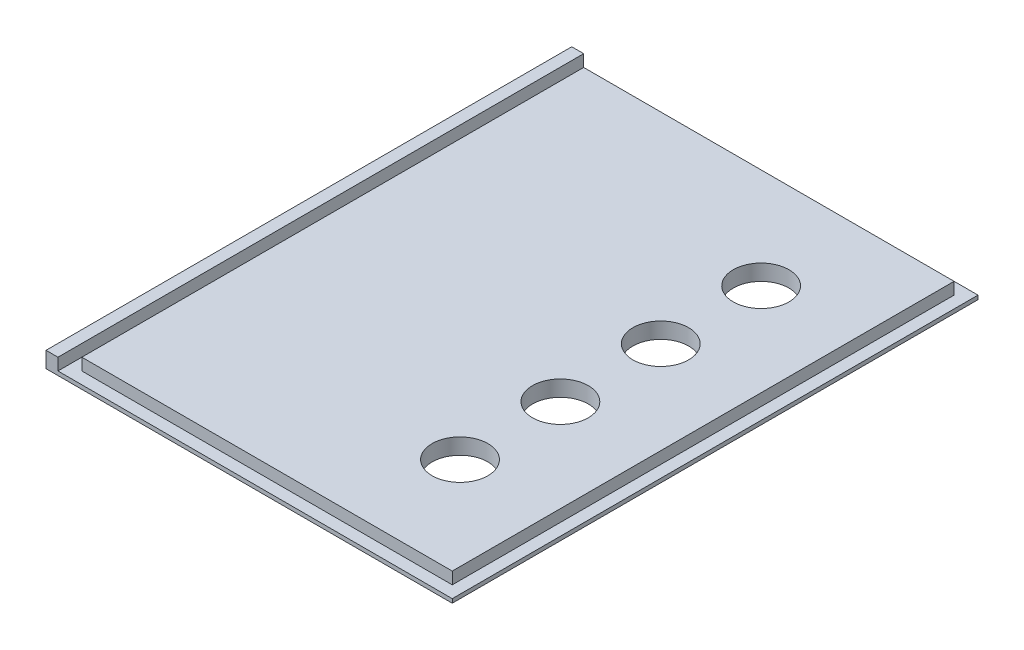
ISO-10303-21;
HEADER;
FILE_DESCRIPTION(('STEP AP214'),'2;1');
FILE_NAME('part.step','',(''),(''),'','','');
FILE_SCHEMA(('AUTOMOTIVE_DESIGN { 1 0 10303 214 1 1 1 1 }'));
ENDSEC;
DATA;
#1=APPLICATION_CONTEXT('core data for automotive mechanical design processes');
#2=APPLICATION_PROTOCOL_DEFINITION('international standard','automotive_design',2000,#1);
#3=PRODUCT_CONTEXT('',#1,'mechanical');
#4=PRODUCT('Part','Part','',(#3));
#5=PRODUCT_RELATED_PRODUCT_CATEGORY('part','',(#4));
#6=PRODUCT_DEFINITION_FORMATION('','',#4);
#7=PRODUCT_DEFINITION_CONTEXT('part definition',#1,'design');
#8=PRODUCT_DEFINITION('design','',#6,#7);
#9=PRODUCT_DEFINITION_SHAPE('','',#8);
#10=(LENGTH_UNIT() NAMED_UNIT(*) SI_UNIT(.MILLI.,.METRE.));
#11=(NAMED_UNIT(*) PLANE_ANGLE_UNIT() SI_UNIT($,.RADIAN.));
#12=(NAMED_UNIT(*) SI_UNIT($,.STERADIAN.) SOLID_ANGLE_UNIT());
#13=UNCERTAINTY_MEASURE_WITH_UNIT(LENGTH_MEASURE(1.E-05),#10,'distance_accuracy_value','');
#14=(GEOMETRIC_REPRESENTATION_CONTEXT(3) GLOBAL_UNCERTAINTY_ASSIGNED_CONTEXT((#13)) GLOBAL_UNIT_ASSIGNED_CONTEXT((#10,
#11,#12)) REPRESENTATION_CONTEXT('',''));
#15=CARTESIAN_POINT('',(0.,0.,0.));
#16=DIRECTION('',(0.,0.,1.));
#17=DIRECTION('',(1.,0.,0.));
#18=AXIS2_PLACEMENT_3D('',#15,#16,#17);
#19=CARTESIAN_POINT('',(0.,1.,0.));
#20=DIRECTION('',(0.,1.,0.));
#21=DIRECTION('',(0.,0.,1.));
#22=AXIS2_PLACEMENT_3D('',#19,#20,#21);
#23=PLANE('',#22);
#24=DIRECTION('',(0.,0.,-1.));
#25=VECTOR('',#24,1.);
#26=CARTESIAN_POINT('',(-48.,1.,-66.));
#27=LINE('',#26,#25);
#28=CARTESIAN_POINT('',(-48.,1.,66.));
#29=VERTEX_POINT('',#28);
#30=CARTESIAN_POINT('',(-48.,1.,-66.));
#31=VERTEX_POINT('',#30);
#32=EDGE_CURVE('E56',#29,#31,#27,.T.);
#33=ORIENTED_EDGE('',*,*,#32,.F.);
#34=DIRECTION('',(1.,0.,0.));
#35=VECTOR('',#34,1.);
#36=CARTESIAN_POINT('',(-51.,1.,66.));
#37=LINE('',#36,#35);
#38=CARTESIAN_POINT('',(51.,1.,66.));
#39=VERTEX_POINT('',#38);
#40=EDGE_CURVE('E163',#29,#39,#37,.T.);
#41=ORIENTED_EDGE('',*,*,#40,.T.);
#42=DIRECTION('',(0.,0.,-1.));
#43=VECTOR('',#42,1.);
#44=CARTESIAN_POINT('',(51.,1.,-66.));
#45=LINE('',#44,#43);
#46=CARTESIAN_POINT('',(51.,1.,-66.));
#47=VERTEX_POINT('',#46);
#48=EDGE_CURVE('E157',#39,#47,#45,.T.);
#49=ORIENTED_EDGE('',*,*,#48,.T.);
#50=DIRECTION('',(-1.,0.,0.));
#51=VECTOR('',#50,1.);
#52=CARTESIAN_POINT('',(-51.,1.,-66.));
#53=LINE('',#52,#51);
#54=EDGE_CURVE('E160',#47,#31,#53,.T.);
#55=ORIENTED_EDGE('',*,*,#54,.T.);
#56=EDGE_LOOP('',(#33,#41,#49,#55));
#57=FACE_BOUND('',#56,.T.);
#58=DIRECTION('',(-1.,0.,0.));
#59=VECTOR('',#58,1.);
#60=CARTESIAN_POINT('',(-45.,1.,-63.));
#61=LINE('',#60,#59);
#62=CARTESIAN_POINT('',(48.,1.,-63.));
#63=VERTEX_POINT('',#62);
#64=CARTESIAN_POINT('',(-45.,1.,-63.));
#65=VERTEX_POINT('',#64);
#66=EDGE_CURVE('E347',#63,#65,#61,.T.);
#67=ORIENTED_EDGE('',*,*,#66,.F.);
#68=DIRECTION('',(0.,0.,-1.));
#69=VECTOR('',#68,1.);
#70=CARTESIAN_POINT('',(48.,1.,-63.));
#71=LINE('',#70,#69);
#72=CARTESIAN_POINT('',(48.,1.,63.));
#73=VERTEX_POINT('',#72);
#74=EDGE_CURVE('E133',#73,#63,#71,.T.);
#75=ORIENTED_EDGE('',*,*,#74,.F.);
#76=DIRECTION('',(1.,0.,0.));
#77=VECTOR('',#76,1.);
#78=CARTESIAN_POINT('',(-45.,1.,63.));
#79=LINE('',#78,#77);
#80=CARTESIAN_POINT('',(-45.,1.,63.));
#81=VERTEX_POINT('',#80);
#82=EDGE_CURVE('E129',#81,#73,#79,.T.);
#83=ORIENTED_EDGE('',*,*,#82,.F.);
#84=DIRECTION('',(0.,0.,1.));
#85=VECTOR('',#84,1.);
#86=CARTESIAN_POINT('',(-45.,1.,-63.));
#87=LINE('',#86,#85);
#88=EDGE_CURVE('E349',#65,#81,#87,.T.);
#89=ORIENTED_EDGE('',*,*,#88,.F.);
#90=EDGE_LOOP('',(#67,#75,#83,#89));
#91=FACE_BOUND('',#90,.T.);
#92=ADVANCED_FACE('F33',(#57,#91),#23,.T.);
#93=CARTESIAN_POINT('',(51.,1.,-66.));
#94=DIRECTION('',(-1.,0.,0.));
#95=DIRECTION('',(0.,0.,1.));
#96=AXIS2_PLACEMENT_3D('',#93,#94,#95);
#97=PLANE('',#96);
#98=DIRECTION('',(0.,0.,-1.));
#99=VECTOR('',#98,1.);
#100=CARTESIAN_POINT('',(51.,0.,-66.));
#101=LINE('',#100,#99);
#102=CARTESIAN_POINT('',(51.,0.,66.));
#103=VERTEX_POINT('',#102);
#104=CARTESIAN_POINT('',(51.,0.,-66.));
#105=VERTEX_POINT('',#104);
#106=EDGE_CURVE('E156',#103,#105,#101,.T.);
#107=ORIENTED_EDGE('',*,*,#106,.T.);
#108=DIRECTION('',(0.,-1.,0.));
#109=VECTOR('',#108,1.);
#110=CARTESIAN_POINT('',(51.,1.,-66.));
#111=LINE('',#110,#109);
#112=EDGE_CURVE('E11',#47,#105,#111,.T.);
#113=ORIENTED_EDGE('',*,*,#112,.F.);
#114=ORIENTED_EDGE('',*,*,#48,.F.);
#115=DIRECTION('',(0.,-1.,0.));
#116=VECTOR('',#115,1.);
#117=CARTESIAN_POINT('',(51.,1.,66.));
#118=LINE('',#117,#116);
#119=EDGE_CURVE('E165',#39,#103,#118,.T.);
#120=ORIENTED_EDGE('',*,*,#119,.T.);
#121=EDGE_LOOP('',(#107,#113,#114,#120));
#122=FACE_BOUND('',#121,.T.);
#123=ADVANCED_FACE('F35',(#122),#97,.F.);
#124=CARTESIAN_POINT('',(-51.,1.,-66.));
#125=DIRECTION('',(0.,0.,1.));
#126=DIRECTION('',(1.,0.,0.));
#127=AXIS2_PLACEMENT_3D('',#124,#125,#126);
#128=PLANE('',#127);
#129=DIRECTION('',(-1.,0.,0.));
#130=VECTOR('',#129,1.);
#131=CARTESIAN_POINT('',(-51.,0.,-66.));
#132=LINE('',#131,#130);
#133=CARTESIAN_POINT('',(-51.,0.,-66.));
#134=VERTEX_POINT('',#133);
#135=EDGE_CURVE('E168',#105,#134,#132,.T.);
#136=ORIENTED_EDGE('',*,*,#135,.T.);
#137=DIRECTION('',(0.,-1.,0.));
#138=VECTOR('',#137,1.);
#139=CARTESIAN_POINT('',(-51.,1.,-66.));
#140=LINE('',#139,#138);
#141=CARTESIAN_POINT('',(-51.,4.,-66.));
#142=VERTEX_POINT('',#141);
#143=EDGE_CURVE('E41',#142,#134,#140,.T.);
#144=ORIENTED_EDGE('',*,*,#143,.F.);
#145=DIRECTION('',(-1.,0.,0.));
#146=VECTOR('',#145,1.);
#147=CARTESIAN_POINT('',(-51.,4.,-66.));
#148=LINE('',#147,#146);
#149=CARTESIAN_POINT('',(-48.,4.,-66.));
#150=VERTEX_POINT('',#149);
#151=EDGE_CURVE('E147',#150,#142,#148,.T.);
#152=ORIENTED_EDGE('',*,*,#151,.F.);
#153=DIRECTION('',(0.,-1.,0.));
#154=VECTOR('',#153,1.);
#155=CARTESIAN_POINT('',(-48.,4.,-66.));
#156=LINE('',#155,#154);
#157=EDGE_CURVE('E149',#150,#31,#156,.T.);
#158=ORIENTED_EDGE('',*,*,#157,.T.);
#159=ORIENTED_EDGE('',*,*,#54,.F.);
#160=ORIENTED_EDGE('',*,*,#112,.T.);
#161=EDGE_LOOP('',(#136,#144,#152,#158,#159,#160));
#162=FACE_BOUND('',#161,.T.);
#163=ADVANCED_FACE('F203',(#162),#128,.F.);
#164=CARTESIAN_POINT('',(-51.,1.,-66.));
#165=DIRECTION('',(1.,0.,0.));
#166=DIRECTION('',(0.,0.,-1.));
#167=AXIS2_PLACEMENT_3D('',#164,#165,#166);
#168=PLANE('',#167);
#169=DIRECTION('',(0.,0.,1.));
#170=VECTOR('',#169,1.);
#171=CARTESIAN_POINT('',(-51.,0.,-66.));
#172=LINE('',#171,#170);
#173=CARTESIAN_POINT('',(-51.,0.,66.));
#174=VERTEX_POINT('',#173);
#175=EDGE_CURVE('E170',#134,#174,#172,.T.);
#176=ORIENTED_EDGE('',*,*,#175,.T.);
#177=DIRECTION('',(0.,-1.,0.));
#178=VECTOR('',#177,1.);
#179=CARTESIAN_POINT('',(-51.,1.,66.));
#180=LINE('',#179,#178);
#181=CARTESIAN_POINT('',(-51.,4.,66.));
#182=VERTEX_POINT('',#181);
#183=EDGE_CURVE('E175',#182,#174,#180,.T.);
#184=ORIENTED_EDGE('',*,*,#183,.F.);
#185=DIRECTION('',(0.,0.,1.));
#186=VECTOR('',#185,1.);
#187=CARTESIAN_POINT('',(-51.,4.,-66.));
#188=LINE('',#187,#186);
#189=EDGE_CURVE('E136',#142,#182,#188,.T.);
#190=ORIENTED_EDGE('',*,*,#189,.F.);
#191=ORIENTED_EDGE('',*,*,#143,.T.);
#192=EDGE_LOOP('',(#176,#184,#190,#191));
#193=FACE_BOUND('',#192,.T.);
#194=ADVANCED_FACE('F181',(#193),#168,.F.);
#195=CARTESIAN_POINT('',(-51.,1.,66.));
#196=DIRECTION('',(0.,0.,-1.));
#197=DIRECTION('',(-1.,0.,0.));
#198=AXIS2_PLACEMENT_3D('',#195,#196,#197);
#199=PLANE('',#198);
#200=DIRECTION('',(1.,0.,0.));
#201=VECTOR('',#200,1.);
#202=CARTESIAN_POINT('',(-51.,0.,66.));
#203=LINE('',#202,#201);
#204=EDGE_CURVE('E161',#174,#103,#203,.T.);
#205=ORIENTED_EDGE('',*,*,#204,.T.);
#206=ORIENTED_EDGE('',*,*,#119,.F.);
#207=ORIENTED_EDGE('',*,*,#40,.F.);
#208=DIRECTION('',(0.,-1.,0.));
#209=VECTOR('',#208,1.);
#210=CARTESIAN_POINT('',(-48.,4.,66.));
#211=LINE('',#210,#209);
#212=CARTESIAN_POINT('',(-48.,4.,66.));
#213=VERTEX_POINT('',#212);
#214=EDGE_CURVE('E153',#213,#29,#211,.T.);
#215=ORIENTED_EDGE('',*,*,#214,.F.);
#216=DIRECTION('',(1.,0.,0.));
#217=VECTOR('',#216,1.);
#218=CARTESIAN_POINT('',(-51.,4.,66.));
#219=LINE('',#218,#217);
#220=EDGE_CURVE('E143',#182,#213,#219,.T.);
#221=ORIENTED_EDGE('',*,*,#220,.F.);
#222=ORIENTED_EDGE('',*,*,#183,.T.);
#223=EDGE_LOOP('',(#205,#206,#207,#215,#221,#222));
#224=FACE_BOUND('',#223,.T.);
#225=ADVANCED_FACE('F190',(#224),#199,.F.);
#226=CARTESIAN_POINT('',(0.,0.,0.));
#227=DIRECTION('',(0.,1.,0.));
#228=DIRECTION('',(0.,0.,1.));
#229=AXIS2_PLACEMENT_3D('',#226,#227,#228);
#230=PLANE('',#229);
#231=CARTESIAN_POINT('',(24.75,0.,37.8));
#232=DIRECTION('',(0.,1.,0.));
#233=DIRECTION('',(0.,0.,1.));
#234=AXIS2_PLACEMENT_3D('',#231,#232,#233);
#235=CIRCLE('',#234,7.);
#236=CARTESIAN_POINT('',(24.75,0.,44.8));
#237=VERTEX_POINT('',#236);
#238=EDGE_CURVE('E324',#237,#237,#235,.T.);
#239=ORIENTED_EDGE('',*,*,#238,.T.);
#240=EDGE_LOOP('',(#239));
#241=FACE_BOUND('',#240,.T.);
#242=CARTESIAN_POINT('',(24.75,0.,-37.8));
#243=DIRECTION('',(0.,1.,0.));
#244=DIRECTION('',(0.,0.,1.));
#245=AXIS2_PLACEMENT_3D('',#242,#243,#244);
#246=CIRCLE('',#245,7.);
#247=CARTESIAN_POINT('',(24.75,0.,-30.8));
#248=VERTEX_POINT('',#247);
#249=EDGE_CURVE('E328',#248,#248,#246,.T.);
#250=ORIENTED_EDGE('',*,*,#249,.T.);
#251=EDGE_LOOP('',(#250));
#252=FACE_BOUND('',#251,.T.);
#253=CARTESIAN_POINT('',(24.75,0.,12.6));
#254=DIRECTION('',(0.,1.,0.));
#255=DIRECTION('',(0.,0.,1.));
#256=AXIS2_PLACEMENT_3D('',#253,#254,#255);
#257=CIRCLE('',#256,7.);
#258=CARTESIAN_POINT('',(24.75,0.,19.6));
#259=VERTEX_POINT('',#258);
#260=EDGE_CURVE('E360',#259,#259,#257,.T.);
#261=ORIENTED_EDGE('',*,*,#260,.T.);
#262=EDGE_LOOP('',(#261));
#263=FACE_BOUND('',#262,.T.);
#264=CARTESIAN_POINT('',(24.75,0.,-12.6));
#265=DIRECTION('',(0.,1.,0.));
#266=DIRECTION('',(0.,0.,1.));
#267=AXIS2_PLACEMENT_3D('',#264,#265,#266);
#268=CIRCLE('',#267,7.);
#269=CARTESIAN_POINT('',(24.75,0.,-5.6));
#270=VERTEX_POINT('',#269);
#271=EDGE_CURVE('E336',#270,#270,#268,.T.);
#272=ORIENTED_EDGE('',*,*,#271,.T.);
#273=EDGE_LOOP('',(#272));
#274=FACE_BOUND('',#273,.T.);
#275=ORIENTED_EDGE('',*,*,#106,.F.);
#276=ORIENTED_EDGE('',*,*,#204,.F.);
#277=ORIENTED_EDGE('',*,*,#175,.F.);
#278=ORIENTED_EDGE('',*,*,#135,.F.);
#279=EDGE_LOOP('',(#275,#276,#277,#278));
#280=FACE_BOUND('',#279,.T.);
#281=ADVANCED_FACE('F187',(#241,#252,#263,#274,#280),#230,.F.);
#282=CARTESIAN_POINT('',(-48.,4.,-66.));
#283=DIRECTION('',(-1.,0.,0.));
#284=DIRECTION('',(0.,0.,1.));
#285=AXIS2_PLACEMENT_3D('',#282,#283,#284);
#286=PLANE('',#285);
#287=ORIENTED_EDGE('',*,*,#32,.T.);
#288=ORIENTED_EDGE('',*,*,#157,.F.);
#289=DIRECTION('',(0.,0.,-1.));
#290=VECTOR('',#289,1.);
#291=CARTESIAN_POINT('',(-48.,4.,-66.));
#292=LINE('',#291,#290);
#293=EDGE_CURVE('E145',#213,#150,#292,.T.);
#294=ORIENTED_EDGE('',*,*,#293,.F.);
#295=ORIENTED_EDGE('',*,*,#214,.T.);
#296=EDGE_LOOP('',(#287,#288,#294,#295));
#297=FACE_BOUND('',#296,.T.);
#298=ADVANCED_FACE('F199',(#297),#286,.F.);
#299=CARTESIAN_POINT('',(0.,4.,0.));
#300=DIRECTION('',(0.,1.,0.));
#301=DIRECTION('',(0.,0.,1.));
#302=AXIS2_PLACEMENT_3D('',#299,#300,#301);
#303=PLANE('',#302);
#304=ORIENTED_EDGE('',*,*,#189,.T.);
#305=ORIENTED_EDGE('',*,*,#220,.T.);
#306=ORIENTED_EDGE('',*,*,#293,.T.);
#307=ORIENTED_EDGE('',*,*,#151,.T.);
#308=EDGE_LOOP('',(#304,#305,#306,#307));
#309=FACE_BOUND('',#308,.T.);
#310=ADVANCED_FACE('F202',(#309),#303,.T.);
#311=CARTESIAN_POINT('',(48.,4.,-63.));
#312=DIRECTION('',(-1.,0.,0.));
#313=DIRECTION('',(0.,0.,1.));
#314=AXIS2_PLACEMENT_3D('',#311,#312,#313);
#315=PLANE('',#314);
#316=ORIENTED_EDGE('',*,*,#74,.T.);
#317=DIRECTION('',(0.,-1.,0.));
#318=VECTOR('',#317,1.);
#319=CARTESIAN_POINT('',(48.,4.,-63.));
#320=LINE('',#319,#318);
#321=CARTESIAN_POINT('',(48.,4.,-63.));
#322=VERTEX_POINT('',#321);
#323=EDGE_CURVE('E114',#322,#63,#320,.T.);
#324=ORIENTED_EDGE('',*,*,#323,.F.);
#325=DIRECTION('',(0.,0.,-1.));
#326=VECTOR('',#325,1.);
#327=CARTESIAN_POINT('',(48.,4.,-63.));
#328=LINE('',#327,#326);
#329=CARTESIAN_POINT('',(48.,4.,63.));
#330=VERTEX_POINT('',#329);
#331=EDGE_CURVE('E121',#330,#322,#328,.T.);
#332=ORIENTED_EDGE('',*,*,#331,.F.);
#333=DIRECTION('',(0.,-1.,0.));
#334=VECTOR('',#333,1.);
#335=CARTESIAN_POINT('',(48.,4.,63.));
#336=LINE('',#335,#334);
#337=EDGE_CURVE('E345',#330,#73,#336,.T.);
#338=ORIENTED_EDGE('',*,*,#337,.T.);
#339=EDGE_LOOP('',(#316,#324,#332,#338));
#340=FACE_BOUND('',#339,.T.);
#341=ADVANCED_FACE('F131',(#340),#315,.F.);
#342=CARTESIAN_POINT('',(-45.,4.,-63.));
#343=DIRECTION('',(0.,0.,1.));
#344=DIRECTION('',(1.,0.,0.));
#345=AXIS2_PLACEMENT_3D('',#342,#343,#344);
#346=PLANE('',#345);
#347=ORIENTED_EDGE('',*,*,#66,.T.);
#348=DIRECTION('',(0.,-1.,0.));
#349=VECTOR('',#348,1.);
#350=CARTESIAN_POINT('',(-45.,4.,-63.));
#351=LINE('',#350,#349);
#352=CARTESIAN_POINT('',(-45.,4.,-63.));
#353=VERTEX_POINT('',#352);
#354=EDGE_CURVE('E117',#353,#65,#351,.T.);
#355=ORIENTED_EDGE('',*,*,#354,.F.);
#356=DIRECTION('',(-1.,0.,0.));
#357=VECTOR('',#356,1.);
#358=CARTESIAN_POINT('',(-45.,4.,-63.));
#359=LINE('',#358,#357);
#360=EDGE_CURVE('E110',#322,#353,#359,.T.);
#361=ORIENTED_EDGE('',*,*,#360,.F.);
#362=ORIENTED_EDGE('',*,*,#323,.T.);
#363=EDGE_LOOP('',(#347,#355,#361,#362));
#364=FACE_BOUND('',#363,.T.);
#365=ADVANCED_FACE('F112',(#364),#346,.F.);
#366=CARTESIAN_POINT('',(-45.,4.,-63.));
#367=DIRECTION('',(1.,0.,0.));
#368=DIRECTION('',(0.,0.,-1.));
#369=AXIS2_PLACEMENT_3D('',#366,#367,#368);
#370=PLANE('',#369);
#371=ORIENTED_EDGE('',*,*,#88,.T.);
#372=DIRECTION('',(0.,-1.,0.));
#373=VECTOR('',#372,1.);
#374=CARTESIAN_POINT('',(-45.,4.,63.));
#375=LINE('',#374,#373);
#376=CARTESIAN_POINT('',(-45.,4.,63.));
#377=VERTEX_POINT('',#376);
#378=EDGE_CURVE('E48',#377,#81,#375,.T.);
#379=ORIENTED_EDGE('',*,*,#378,.F.);
#380=DIRECTION('',(0.,0.,1.));
#381=VECTOR('',#380,1.);
#382=CARTESIAN_POINT('',(-45.,4.,-63.));
#383=LINE('',#382,#381);
#384=EDGE_CURVE('E120',#353,#377,#383,.T.);
#385=ORIENTED_EDGE('',*,*,#384,.F.);
#386=ORIENTED_EDGE('',*,*,#354,.T.);
#387=EDGE_LOOP('',(#371,#379,#385,#386));
#388=FACE_BOUND('',#387,.T.);
#389=ADVANCED_FACE('F257',(#388),#370,.F.);
#390=CARTESIAN_POINT('',(-45.,4.,63.));
#391=DIRECTION('',(0.,0.,-1.));
#392=DIRECTION('',(-1.,0.,0.));
#393=AXIS2_PLACEMENT_3D('',#390,#391,#392);
#394=PLANE('',#393);
#395=ORIENTED_EDGE('',*,*,#82,.T.);
#396=ORIENTED_EDGE('',*,*,#337,.F.);
#397=DIRECTION('',(1.,0.,0.));
#398=VECTOR('',#397,1.);
#399=CARTESIAN_POINT('',(-45.,4.,63.));
#400=LINE('',#399,#398);
#401=EDGE_CURVE('E125',#377,#330,#400,.T.);
#402=ORIENTED_EDGE('',*,*,#401,.F.);
#403=ORIENTED_EDGE('',*,*,#378,.T.);
#404=EDGE_LOOP('',(#395,#396,#402,#403));
#405=FACE_BOUND('',#404,.T.);
#406=ADVANCED_FACE('F264',(#405),#394,.F.);
#407=CARTESIAN_POINT('',(0.,4.,0.));
#408=DIRECTION('',(0.,1.,0.));
#409=DIRECTION('',(0.,0.,1.));
#410=AXIS2_PLACEMENT_3D('',#407,#408,#409);
#411=PLANE('',#410);
#412=CARTESIAN_POINT('',(24.75,4.,37.8));
#413=DIRECTION('',(0.,1.,0.));
#414=DIRECTION('',(0.,0.,1.));
#415=AXIS2_PLACEMENT_3D('',#412,#413,#414);
#416=CIRCLE('',#415,7.);
#417=CARTESIAN_POINT('',(24.75,4.,44.8));
#418=VERTEX_POINT('',#417);
#419=EDGE_CURVE('E327',#418,#418,#416,.T.);
#420=ORIENTED_EDGE('',*,*,#419,.F.);
#421=EDGE_LOOP('',(#420));
#422=FACE_BOUND('',#421,.T.);
#423=CARTESIAN_POINT('',(24.75,4.,-37.8));
#424=DIRECTION('',(0.,1.,0.));
#425=DIRECTION('',(0.,0.,1.));
#426=AXIS2_PLACEMENT_3D('',#423,#424,#425);
#427=CIRCLE('',#426,7.);
#428=CARTESIAN_POINT('',(24.75,4.,-30.8));
#429=VERTEX_POINT('',#428);
#430=EDGE_CURVE('E331',#429,#429,#427,.T.);
#431=ORIENTED_EDGE('',*,*,#430,.F.);
#432=EDGE_LOOP('',(#431));
#433=FACE_BOUND('',#432,.T.);
#434=CARTESIAN_POINT('',(24.75,4.,12.6));
#435=DIRECTION('',(0.,1.,0.));
#436=DIRECTION('',(0.,0.,1.));
#437=AXIS2_PLACEMENT_3D('',#434,#435,#436);
#438=CIRCLE('',#437,7.);
#439=CARTESIAN_POINT('',(24.75,4.,19.6));
#440=VERTEX_POINT('',#439);
#441=EDGE_CURVE('E340',#440,#440,#438,.T.);
#442=ORIENTED_EDGE('',*,*,#441,.F.);
#443=EDGE_LOOP('',(#442));
#444=FACE_BOUND('',#443,.T.);
#445=CARTESIAN_POINT('',(24.75,4.,-12.6));
#446=DIRECTION('',(0.,1.,0.));
#447=DIRECTION('',(0.,0.,1.));
#448=AXIS2_PLACEMENT_3D('',#445,#446,#447);
#449=CIRCLE('',#448,7.);
#450=CARTESIAN_POINT('',(24.75,4.,-5.6));
#451=VERTEX_POINT('',#450);
#452=EDGE_CURVE('E339',#451,#451,#449,.T.);
#453=ORIENTED_EDGE('',*,*,#452,.F.);
#454=EDGE_LOOP('',(#453));
#455=FACE_BOUND('',#454,.T.);
#456=ORIENTED_EDGE('',*,*,#331,.T.);
#457=ORIENTED_EDGE('',*,*,#360,.T.);
#458=ORIENTED_EDGE('',*,*,#384,.T.);
#459=ORIENTED_EDGE('',*,*,#401,.T.);
#460=EDGE_LOOP('',(#456,#457,#458,#459));
#461=FACE_BOUND('',#460,.T.);
#462=ADVANCED_FACE('F124',(#422,#433,#444,#455,#461),#411,.T.);
#463=CARTESIAN_POINT('',(24.75,23.7989898732233,-12.6));
#464=DIRECTION('',(0.,-1.,0.));
#465=DIRECTION('',(0.,0.,-1.));
#466=AXIS2_PLACEMENT_3D('',#463,#464,#465);
#467=CYLINDRICAL_SURFACE('',#466,7.);
#468=ORIENTED_EDGE('',*,*,#271,.F.);
#469=EDGE_LOOP('',(#468));
#470=FACE_BOUND('',#469,.T.);
#471=ORIENTED_EDGE('',*,*,#452,.T.);
#472=EDGE_LOOP('',(#471));
#473=FACE_BOUND('',#472,.T.);
#474=ADVANCED_FACE('F277',(#470,#473),#467,.F.);
#475=CARTESIAN_POINT('',(24.75,23.7989898732233,12.6));
#476=DIRECTION('',(0.,-1.,0.));
#477=DIRECTION('',(0.,0.,-1.));
#478=AXIS2_PLACEMENT_3D('',#475,#476,#477);
#479=CYLINDRICAL_SURFACE('',#478,7.);
#480=ORIENTED_EDGE('',*,*,#260,.F.);
#481=EDGE_LOOP('',(#480));
#482=FACE_BOUND('',#481,.T.);
#483=ORIENTED_EDGE('',*,*,#441,.T.);
#484=EDGE_LOOP('',(#483));
#485=FACE_BOUND('',#484,.T.);
#486=ADVANCED_FACE('F287',(#482,#485),#479,.F.);
#487=CARTESIAN_POINT('',(24.75,23.7989898732233,-37.8));
#488=DIRECTION('',(0.,-1.,0.));
#489=DIRECTION('',(0.,0.,-1.));
#490=AXIS2_PLACEMENT_3D('',#487,#488,#489);
#491=CYLINDRICAL_SURFACE('',#490,7.);
#492=ORIENTED_EDGE('',*,*,#249,.F.);
#493=EDGE_LOOP('',(#492));
#494=FACE_BOUND('',#493,.T.);
#495=ORIENTED_EDGE('',*,*,#430,.T.);
#496=EDGE_LOOP('',(#495));
#497=FACE_BOUND('',#496,.T.);
#498=ADVANCED_FACE('F294',(#494,#497),#491,.F.);
#499=CARTESIAN_POINT('',(24.75,23.7989898732233,37.8));
#500=DIRECTION('',(0.,-1.,0.));
#501=DIRECTION('',(0.,0.,-1.));
#502=AXIS2_PLACEMENT_3D('',#499,#500,#501);
#503=CYLINDRICAL_SURFACE('',#502,7.);
#504=ORIENTED_EDGE('',*,*,#238,.F.);
#505=EDGE_LOOP('',(#504));
#506=FACE_BOUND('',#505,.T.);
#507=ORIENTED_EDGE('',*,*,#419,.T.);
#508=EDGE_LOOP('',(#507));
#509=FACE_BOUND('',#508,.T.);
#510=ADVANCED_FACE('F302',(#506,#509),#503,.F.);
#511=CLOSED_SHELL('',(#92,#123,#163,#194,#225,#281,#298,#310,#341,#365,#389,#406,#462,#474,#486,
#498,#510));
#512=MANIFOLD_SOLID_BREP('B2',#511);
#513=ADVANCED_BREP_SHAPE_REPRESENTATION('',(#18,#512),#14);
#514=SHAPE_DEFINITION_REPRESENTATION(#9,#513);
ENDSEC;
END-ISO-10303-21;
